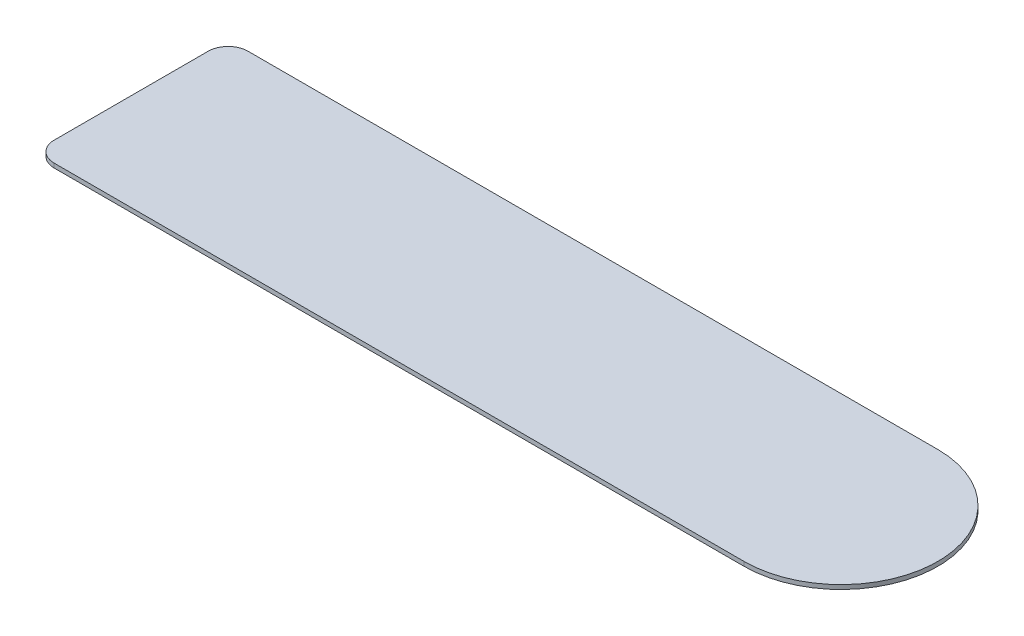
ISO-10303-21;
HEADER;
FILE_DESCRIPTION(('STEP AP214'),'2;1');
FILE_NAME('part.step','',(''),(''),'','','');
FILE_SCHEMA(('AUTOMOTIVE_DESIGN { 1 0 10303 214 1 1 1 1 }'));
ENDSEC;
DATA;
#1=APPLICATION_CONTEXT('core data for automotive mechanical design processes');
#2=APPLICATION_PROTOCOL_DEFINITION('international standard','automotive_design',2000,#1);
#3=PRODUCT_CONTEXT('',#1,'mechanical');
#4=PRODUCT('Part','Part','',(#3));
#5=PRODUCT_RELATED_PRODUCT_CATEGORY('part','',(#4));
#6=PRODUCT_DEFINITION_FORMATION('','',#4);
#7=PRODUCT_DEFINITION_CONTEXT('part definition',#1,'design');
#8=PRODUCT_DEFINITION('design','',#6,#7);
#9=PRODUCT_DEFINITION_SHAPE('','',#8);
#10=(LENGTH_UNIT() NAMED_UNIT(*) SI_UNIT(.MILLI.,.METRE.));
#11=(NAMED_UNIT(*) PLANE_ANGLE_UNIT() SI_UNIT($,.RADIAN.));
#12=(NAMED_UNIT(*) SI_UNIT($,.STERADIAN.) SOLID_ANGLE_UNIT());
#13=UNCERTAINTY_MEASURE_WITH_UNIT(LENGTH_MEASURE(1.E-05),#10,'distance_accuracy_value','');
#14=(GEOMETRIC_REPRESENTATION_CONTEXT(3) GLOBAL_UNCERTAINTY_ASSIGNED_CONTEXT((#13)) GLOBAL_UNIT_ASSIGNED_CONTEXT((#10,
#11,#12)) REPRESENTATION_CONTEXT('',''));
#15=CARTESIAN_POINT('',(0.,0.,0.));
#16=DIRECTION('',(0.,0.,1.));
#17=DIRECTION('',(1.,0.,0.));
#18=AXIS2_PLACEMENT_3D('',#15,#16,#17);
#19=CARTESIAN_POINT('',(360.,1.5,4.04499180678419E-06));
#20=DIRECTION('',(0.,-1.,0.));
#21=DIRECTION('',(0.,0.,-1.));
#22=AXIS2_PLACEMENT_3D('',#19,#20,#21);
#23=CYLINDRICAL_SURFACE('',#22,33.9999970299869);
#24=CARTESIAN_POINT('',(360.,0.,4.04499180678419E-06));
#25=DIRECTION('',(0.,1.,0.));
#26=DIRECTION('',(0.,0.,1.));
#27=AXIS2_PLACEMENT_3D('',#24,#25,#26);
#28=CIRCLE('',#27,33.9999970299869);
#29=CARTESIAN_POINT('',(360.,0.,34.0000010749787));
#30=VERTEX_POINT('',#29);
#31=CARTESIAN_POINT('',(360.,0.,-33.999992984995));
#32=VERTEX_POINT('',#31);
#33=EDGE_CURVE('E118',#30,#32,#28,.T.);
#34=ORIENTED_EDGE('',*,*,#33,.T.);
#35=DIRECTION('',(0.,-1.,0.));
#36=VECTOR('',#35,1.);
#37=CARTESIAN_POINT('',(360.,1.5,-33.999992984995));
#38=LINE('',#37,#36);
#39=CARTESIAN_POINT('',(360.,1.5,-33.999992984995));
#40=VERTEX_POINT('',#39);
#41=EDGE_CURVE('E11',#40,#32,#38,.T.);
#42=ORIENTED_EDGE('',*,*,#41,.F.);
#43=CARTESIAN_POINT('',(360.,1.5,4.04499180678419E-06));
#44=DIRECTION('',(0.,1.,0.));
#45=DIRECTION('',(0.,0.,1.));
#46=AXIS2_PLACEMENT_3D('',#43,#44,#45);
#47=CIRCLE('',#46,33.9999970299869);
#48=CARTESIAN_POINT('',(360.,1.5,34.0000010749787));
#49=VERTEX_POINT('',#48);
#50=EDGE_CURVE('E128',#49,#40,#47,.T.);
#51=ORIENTED_EDGE('',*,*,#50,.F.);
#52=DIRECTION('',(0.,-1.,0.));
#53=VECTOR('',#52,1.);
#54=CARTESIAN_POINT('',(360.,1.5,34.0000010749787));
#55=LINE('',#54,#53);
#56=EDGE_CURVE('E114',#49,#30,#55,.T.);
#57=ORIENTED_EDGE('',*,*,#56,.T.);
#58=EDGE_LOOP('',(#34,#42,#51,#57));
#59=FACE_BOUND('',#58,.T.);
#60=ADVANCED_FACE('F34',(#59),#23,.T.);
#61=CARTESIAN_POINT('',(360.,1.5,-33.999992984995));
#62=DIRECTION('',(0.,0.,1.));
#63=DIRECTION('',(1.,0.,0.));
#64=AXIS2_PLACEMENT_3D('',#61,#62,#63);
#65=PLANE('',#64);
#66=DIRECTION('',(-1.,0.,0.));
#67=VECTOR('',#66,1.);
#68=CARTESIAN_POINT('',(360.,0.,-33.999992984995));
#69=LINE('',#68,#67);
#70=CARTESIAN_POINT('',(118.,0.,-33.999992984995));
#71=VERTEX_POINT('',#70);
#72=EDGE_CURVE('E121',#32,#71,#69,.T.);
#73=ORIENTED_EDGE('',*,*,#72,.T.);
#74=DIRECTION('',(0.,-1.,0.));
#75=VECTOR('',#74,1.);
#76=CARTESIAN_POINT('',(118.,1.5,-33.999992984995));
#77=LINE('',#76,#75);
#78=CARTESIAN_POINT('',(118.,1.5,-33.999992984995));
#79=VERTEX_POINT('',#78);
#80=EDGE_CURVE('E42',#79,#71,#77,.T.);
#81=ORIENTED_EDGE('',*,*,#80,.F.);
#82=DIRECTION('',(-1.,0.,0.));
#83=VECTOR('',#82,1.);
#84=CARTESIAN_POINT('',(360.,1.5,-33.999992984995));
#85=LINE('',#84,#83);
#86=EDGE_CURVE('E87',#40,#79,#85,.T.);
#87=ORIENTED_EDGE('',*,*,#86,.F.);
#88=ORIENTED_EDGE('',*,*,#41,.T.);
#89=EDGE_LOOP('',(#73,#81,#87,#88));
#90=FACE_BOUND('',#89,.T.);
#91=ADVANCED_FACE('F152',(#90),#65,.F.);
#92=CARTESIAN_POINT('',(118.,1.5,-26.999992984995));
#93=DIRECTION('',(0.,-1.,0.));
#94=DIRECTION('',(0.,0.,-1.));
#95=AXIS2_PLACEMENT_3D('',#92,#93,#94);
#96=CYLINDRICAL_SURFACE('',#95,7.);
#97=CARTESIAN_POINT('',(118.,0.,-26.999992984995));
#98=DIRECTION('',(0.,1.,0.));
#99=DIRECTION('',(0.,0.,-1.));
#100=AXIS2_PLACEMENT_3D('',#97,#98,#99);
#101=CIRCLE('',#100,7.);
#102=CARTESIAN_POINT('',(111.,0.,-26.999992984995));
#103=VERTEX_POINT('',#102);
#104=EDGE_CURVE('E123',#71,#103,#101,.T.);
#105=ORIENTED_EDGE('',*,*,#104,.T.);
#106=DIRECTION('',(0.,-1.,0.));
#107=VECTOR('',#106,1.);
#108=CARTESIAN_POINT('',(111.,1.5,-26.999992984995));
#109=LINE('',#108,#107);
#110=CARTESIAN_POINT('',(111.,1.5,-26.999992984995));
#111=VERTEX_POINT('',#110);
#112=EDGE_CURVE('E109',#111,#103,#109,.T.);
#113=ORIENTED_EDGE('',*,*,#112,.F.);
#114=CARTESIAN_POINT('',(118.,1.5,-26.999992984995));
#115=DIRECTION('',(0.,1.,0.));
#116=DIRECTION('',(0.,0.,-1.));
#117=AXIS2_PLACEMENT_3D('',#114,#115,#116);
#118=CIRCLE('',#117,7.);
#119=EDGE_CURVE('E100',#79,#111,#118,.T.);
#120=ORIENTED_EDGE('',*,*,#119,.F.);
#121=ORIENTED_EDGE('',*,*,#80,.T.);
#122=EDGE_LOOP('',(#105,#113,#120,#121));
#123=FACE_BOUND('',#122,.T.);
#124=ADVANCED_FACE('F134',(#123),#96,.T.);
#125=CARTESIAN_POINT('',(111.,1.5,-26.999992984995));
#126=DIRECTION('',(1.,0.,0.));
#127=DIRECTION('',(0.,0.,-1.));
#128=AXIS2_PLACEMENT_3D('',#125,#126,#127);
#129=PLANE('',#128);
#130=DIRECTION('',(0.,0.,1.));
#131=VECTOR('',#130,1.);
#132=CARTESIAN_POINT('',(111.,0.,-26.999992984995));
#133=LINE('',#132,#131);
#134=CARTESIAN_POINT('',(111.,0.,27.0000010749787));
#135=VERTEX_POINT('',#134);
#136=EDGE_CURVE('E108',#103,#135,#133,.T.);
#137=ORIENTED_EDGE('',*,*,#136,.T.);
#138=DIRECTION('',(0.,-1.,0.));
#139=VECTOR('',#138,1.);
#140=CARTESIAN_POINT('',(111.,1.5,27.0000010749787));
#141=LINE('',#140,#139);
#142=CARTESIAN_POINT('',(111.,1.5,27.0000010749787));
#143=VERTEX_POINT('',#142);
#144=EDGE_CURVE('E105',#143,#135,#141,.T.);
#145=ORIENTED_EDGE('',*,*,#144,.F.);
#146=DIRECTION('',(0.,0.,1.));
#147=VECTOR('',#146,1.);
#148=CARTESIAN_POINT('',(111.,1.5,-26.999992984995));
#149=LINE('',#148,#147);
#150=EDGE_CURVE('E94',#111,#143,#149,.T.);
#151=ORIENTED_EDGE('',*,*,#150,.F.);
#152=ORIENTED_EDGE('',*,*,#112,.T.);
#153=EDGE_LOOP('',(#137,#145,#151,#152));
#154=FACE_BOUND('',#153,.T.);
#155=ADVANCED_FACE('F106',(#154),#129,.F.);
#156=CARTESIAN_POINT('',(118.,1.5,27.0000010749787));
#157=DIRECTION('',(0.,-1.,0.));
#158=DIRECTION('',(0.,0.,-1.));
#159=AXIS2_PLACEMENT_3D('',#156,#157,#158);
#160=CYLINDRICAL_SURFACE('',#159,7.00000000000001);
#161=CARTESIAN_POINT('',(118.,0.,27.0000010749787));
#162=DIRECTION('',(0.,1.,0.));
#163=DIRECTION('',(0.,0.,-1.));
#164=AXIS2_PLACEMENT_3D('',#161,#162,#163);
#165=CIRCLE('',#164,7.00000000000001);
#166=CARTESIAN_POINT('',(118.,0.,34.0000010749787));
#167=VERTEX_POINT('',#166);
#168=EDGE_CURVE('E73',#135,#167,#165,.T.);
#169=ORIENTED_EDGE('',*,*,#168,.T.);
#170=DIRECTION('',(0.,-1.,0.));
#171=VECTOR('',#170,1.);
#172=CARTESIAN_POINT('',(118.,1.5,34.0000010749787));
#173=LINE('',#172,#171);
#174=CARTESIAN_POINT('',(118.,1.5,34.0000010749787));
#175=VERTEX_POINT('',#174);
#176=EDGE_CURVE('E110',#175,#167,#173,.T.);
#177=ORIENTED_EDGE('',*,*,#176,.F.);
#178=CARTESIAN_POINT('',(118.,1.5,27.0000010749787));
#179=DIRECTION('',(0.,1.,0.));
#180=DIRECTION('',(0.,0.,-1.));
#181=AXIS2_PLACEMENT_3D('',#178,#179,#180);
#182=CIRCLE('',#181,7.00000000000001);
#183=EDGE_CURVE('E98',#143,#175,#182,.T.);
#184=ORIENTED_EDGE('',*,*,#183,.F.);
#185=ORIENTED_EDGE('',*,*,#144,.T.);
#186=EDGE_LOOP('',(#169,#177,#184,#185));
#187=FACE_BOUND('',#186,.T.);
#188=ADVANCED_FACE('F112',(#187),#160,.T.);
#189=CARTESIAN_POINT('',(118.,1.5,34.0000010749787));
#190=DIRECTION('',(0.,0.,-1.));
#191=DIRECTION('',(-1.,0.,0.));
#192=AXIS2_PLACEMENT_3D('',#189,#190,#191);
#193=PLANE('',#192);
#194=DIRECTION('',(1.,0.,0.));
#195=VECTOR('',#194,1.);
#196=CARTESIAN_POINT('',(118.,0.,34.0000010749787));
#197=LINE('',#196,#195);
#198=EDGE_CURVE('E79',#167,#30,#197,.T.);
#199=ORIENTED_EDGE('',*,*,#198,.T.);
#200=ORIENTED_EDGE('',*,*,#56,.F.);
#201=DIRECTION('',(1.,0.,0.));
#202=VECTOR('',#201,1.);
#203=CARTESIAN_POINT('',(118.,1.5,34.0000010749787));
#204=LINE('',#203,#202);
#205=EDGE_CURVE('E50',#175,#49,#204,.T.);
#206=ORIENTED_EDGE('',*,*,#205,.F.);
#207=ORIENTED_EDGE('',*,*,#176,.T.);
#208=EDGE_LOOP('',(#199,#200,#206,#207));
#209=FACE_BOUND('',#208,.T.);
#210=ADVANCED_FACE('F141',(#209),#193,.F.);
#211=CARTESIAN_POINT('',(360.,1.5,4.04499180678419E-06));
#212=DIRECTION('',(0.,1.,0.));
#213=DIRECTION('',(0.,0.,1.));
#214=AXIS2_PLACEMENT_3D('',#211,#212,#213);
#215=PLANE('',#214);
#216=ORIENTED_EDGE('',*,*,#50,.T.);
#217=ORIENTED_EDGE('',*,*,#86,.T.);
#218=ORIENTED_EDGE('',*,*,#119,.T.);
#219=ORIENTED_EDGE('',*,*,#150,.T.);
#220=ORIENTED_EDGE('',*,*,#183,.T.);
#221=ORIENTED_EDGE('',*,*,#205,.T.);
#222=EDGE_LOOP('',(#216,#217,#218,#219,#220,#221));
#223=FACE_BOUND('',#222,.T.);
#224=ADVANCED_FACE('F96',(#223),#215,.T.);
#225=CARTESIAN_POINT('',(360.,0.,4.04499180678419E-06));
#226=DIRECTION('',(0.,1.,0.));
#227=DIRECTION('',(0.,0.,1.));
#228=AXIS2_PLACEMENT_3D('',#225,#226,#227);
#229=PLANE('',#228);
#230=ORIENTED_EDGE('',*,*,#33,.F.);
#231=ORIENTED_EDGE('',*,*,#198,.F.);
#232=ORIENTED_EDGE('',*,*,#168,.F.);
#233=ORIENTED_EDGE('',*,*,#136,.F.);
#234=ORIENTED_EDGE('',*,*,#104,.F.);
#235=ORIENTED_EDGE('',*,*,#72,.F.);
#236=EDGE_LOOP('',(#230,#231,#232,#233,#234,#235));
#237=FACE_BOUND('',#236,.T.);
#238=ADVANCED_FACE('F137',(#237),#229,.F.);
#239=CLOSED_SHELL('',(#60,#91,#124,#155,#188,#210,#224,#238));
#240=MANIFOLD_SOLID_BREP('B2',#239);
#241=ADVANCED_BREP_SHAPE_REPRESENTATION('',(#18,#240),#14);
#242=SHAPE_DEFINITION_REPRESENTATION(#9,#241);
ENDSEC;
END-ISO-10303-21;
